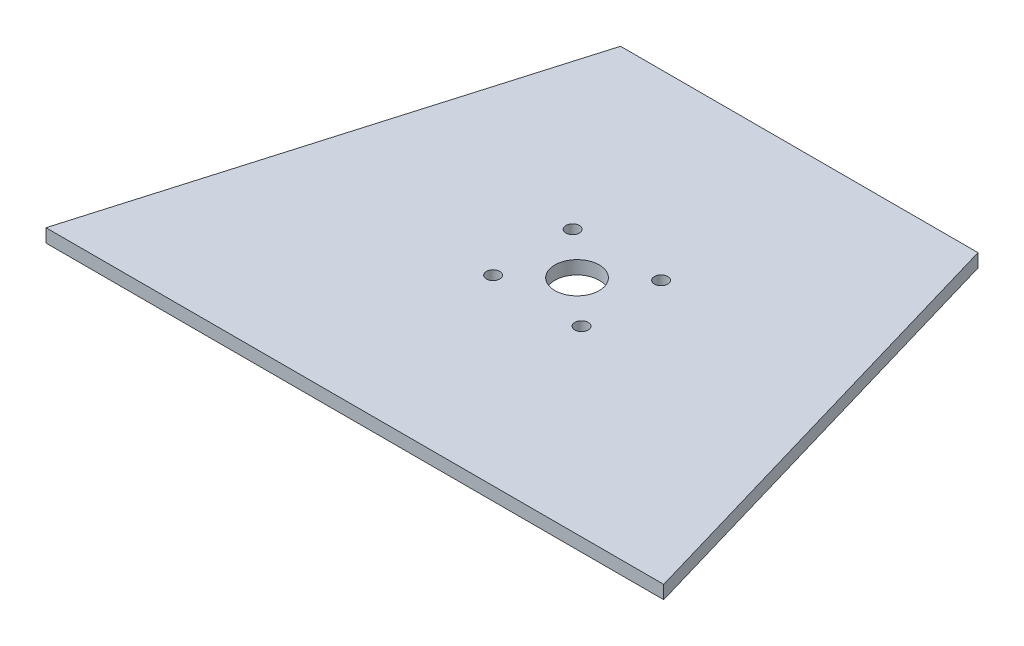
ISO-10303-21;
HEADER;
FILE_DESCRIPTION(('STEP AP214'),'2;1');
FILE_NAME('part.step','',(''),(''),'','','');
FILE_SCHEMA(('AUTOMOTIVE_DESIGN { 1 0 10303 214 1 1 1 1 }'));
ENDSEC;
DATA;
#1=APPLICATION_CONTEXT('core data for automotive mechanical design processes');
#2=APPLICATION_PROTOCOL_DEFINITION('international standard','automotive_design',2000,#1);
#3=PRODUCT_CONTEXT('',#1,'mechanical');
#4=PRODUCT('Part','Part','',(#3));
#5=PRODUCT_RELATED_PRODUCT_CATEGORY('part','',(#4));
#6=PRODUCT_DEFINITION_FORMATION('','',#4);
#7=PRODUCT_DEFINITION_CONTEXT('part definition',#1,'design');
#8=PRODUCT_DEFINITION('design','',#6,#7);
#9=PRODUCT_DEFINITION_SHAPE('','',#8);
#10=(LENGTH_UNIT() NAMED_UNIT(*) SI_UNIT(.MILLI.,.METRE.));
#11=(NAMED_UNIT(*) PLANE_ANGLE_UNIT() SI_UNIT($,.RADIAN.));
#12=(NAMED_UNIT(*) SI_UNIT($,.STERADIAN.) SOLID_ANGLE_UNIT());
#13=UNCERTAINTY_MEASURE_WITH_UNIT(LENGTH_MEASURE(1.E-05),#10,'distance_accuracy_value','');
#14=(GEOMETRIC_REPRESENTATION_CONTEXT(3) GLOBAL_UNCERTAINTY_ASSIGNED_CONTEXT((#13)) GLOBAL_UNIT_ASSIGNED_CONTEXT((#10,
#11,#12)) REPRESENTATION_CONTEXT('',''));
#15=CARTESIAN_POINT('',(0.,0.,0.));
#16=DIRECTION('',(0.,0.,1.));
#17=DIRECTION('',(1.,0.,0.));
#18=AXIS2_PLACEMENT_3D('',#15,#16,#17);
#19=CARTESIAN_POINT('',(0.,3.,0.));
#20=DIRECTION('',(0.959707262339068,0.,0.281001727065248));
#21=DIRECTION('',(0.281001727065248,0.,-0.959707262339068));
#22=AXIS2_PLACEMENT_3D('',#19,#20,#21);
#23=PLANE('',#22);
#24=DIRECTION('',(-0.281001727065248,0.,0.959707262339068));
#25=VECTOR('',#24,1.);
#26=CARTESIAN_POINT('',(0.,0.,0.));
#27=LINE('',#26,#25);
#28=CARTESIAN_POINT('',(29.2799417168492,0.,-100.));
#29=VERTEX_POINT('',#28);
#30=CARTESIAN_POINT('',(0.,0.,0.));
#31=VERTEX_POINT('',#30);
#32=EDGE_CURVE('E101',#29,#31,#27,.T.);
#33=ORIENTED_EDGE('',*,*,#32,.T.);
#34=DIRECTION('',(0.,-1.,0.));
#35=VECTOR('',#34,1.);
#36=CARTESIAN_POINT('',(0.,3.,0.));
#37=LINE('',#36,#35);
#38=CARTESIAN_POINT('',(0.,3.,0.));
#39=VERTEX_POINT('',#38);
#40=EDGE_CURVE('E11',#39,#31,#37,.T.);
#41=ORIENTED_EDGE('',*,*,#40,.F.);
#42=DIRECTION('',(-0.281001727065248,0.,0.959707262339068));
#43=VECTOR('',#42,1.);
#44=CARTESIAN_POINT('',(0.,3.,0.));
#45=LINE('',#44,#43);
#46=CARTESIAN_POINT('',(29.2799417168492,3.,-100.));
#47=VERTEX_POINT('',#46);
#48=EDGE_CURVE('E89',#47,#39,#45,.T.);
#49=ORIENTED_EDGE('',*,*,#48,.F.);
#50=DIRECTION('',(0.,-1.,0.));
#51=VECTOR('',#50,1.);
#52=CARTESIAN_POINT('',(29.2799417168492,3.,-100.));
#53=LINE('',#52,#51);
#54=EDGE_CURVE('E97',#47,#29,#53,.T.);
#55=ORIENTED_EDGE('',*,*,#54,.T.);
#56=EDGE_LOOP('',(#33,#41,#49,#55));
#57=FACE_BOUND('',#56,.T.);
#58=ADVANCED_FACE('F38',(#57),#23,.F.);
#59=CARTESIAN_POINT('',(0.,3.,0.));
#60=DIRECTION('',(0.,0.,-1.));
#61=DIRECTION('',(-1.,0.,0.));
#62=AXIS2_PLACEMENT_3D('',#59,#60,#61);
#63=PLANE('',#62);
#64=DIRECTION('',(1.,0.,0.));
#65=VECTOR('',#64,1.);
#66=CARTESIAN_POINT('',(0.,0.,0.));
#67=LINE('',#66,#65);
#68=CARTESIAN_POINT('',(139.,0.,0.));
#69=VERTEX_POINT('',#68);
#70=EDGE_CURVE('E93',#31,#69,#67,.T.);
#71=ORIENTED_EDGE('',*,*,#70,.T.);
#72=DIRECTION('',(0.,-1.,0.));
#73=VECTOR('',#72,1.);
#74=CARTESIAN_POINT('',(139.,3.,0.));
#75=LINE('',#74,#73);
#76=CARTESIAN_POINT('',(139.,3.,0.));
#77=VERTEX_POINT('',#76);
#78=EDGE_CURVE('E46',#77,#69,#75,.T.);
#79=ORIENTED_EDGE('',*,*,#78,.F.);
#80=DIRECTION('',(1.,0.,0.));
#81=VECTOR('',#80,1.);
#82=CARTESIAN_POINT('',(0.,3.,0.));
#83=LINE('',#82,#81);
#84=EDGE_CURVE('E84',#39,#77,#83,.T.);
#85=ORIENTED_EDGE('',*,*,#84,.F.);
#86=ORIENTED_EDGE('',*,*,#40,.T.);
#87=EDGE_LOOP('',(#71,#79,#85,#86));
#88=FACE_BOUND('',#87,.T.);
#89=ADVANCED_FACE('F92',(#88),#63,.F.);
#90=CARTESIAN_POINT('',(139.,3.,0.));
#91=DIRECTION('',(-0.959707262339066,0.,0.281001727065255));
#92=DIRECTION('',(0.281001727065255,0.,0.959707262339066));
#93=AXIS2_PLACEMENT_3D('',#90,#91,#92);
#94=PLANE('',#93);
#95=DIRECTION('',(-0.281001727065255,0.,-0.959707262339066));
#96=VECTOR('',#95,1.);
#97=CARTESIAN_POINT('',(139.,0.,0.));
#98=LINE('',#97,#96);
#99=CARTESIAN_POINT('',(109.72005828315,0.,-100.));
#100=VERTEX_POINT('',#99);
#101=EDGE_CURVE('E71',#69,#100,#98,.T.);
#102=ORIENTED_EDGE('',*,*,#101,.T.);
#103=DIRECTION('',(0.,-1.,0.));
#104=VECTOR('',#103,1.);
#105=CARTESIAN_POINT('',(109.72005828315,3.,-100.));
#106=LINE('',#105,#104);
#107=CARTESIAN_POINT('',(109.72005828315,3.,-100.));
#108=VERTEX_POINT('',#107);
#109=EDGE_CURVE('E94',#108,#100,#106,.T.);
#110=ORIENTED_EDGE('',*,*,#109,.F.);
#111=DIRECTION('',(-0.281001727065255,0.,-0.959707262339066));
#112=VECTOR('',#111,1.);
#113=CARTESIAN_POINT('',(139.,3.,0.));
#114=LINE('',#113,#112);
#115=EDGE_CURVE('E87',#77,#108,#114,.T.);
#116=ORIENTED_EDGE('',*,*,#115,.F.);
#117=ORIENTED_EDGE('',*,*,#78,.T.);
#118=EDGE_LOOP('',(#102,#110,#116,#117));
#119=FACE_BOUND('',#118,.T.);
#120=ADVANCED_FACE('F95',(#119),#94,.F.);
#121=CARTESIAN_POINT('',(29.2799417168492,3.,-100.));
#122=DIRECTION('',(0.,0.,1.));
#123=DIRECTION('',(1.,0.,0.));
#124=AXIS2_PLACEMENT_3D('',#121,#122,#123);
#125=PLANE('',#124);
#126=DIRECTION('',(-1.,0.,0.));
#127=VECTOR('',#126,1.);
#128=CARTESIAN_POINT('',(29.2799417168492,0.,-100.));
#129=LINE('',#128,#127);
#130=EDGE_CURVE('E77',#100,#29,#129,.T.);
#131=ORIENTED_EDGE('',*,*,#130,.T.);
#132=ORIENTED_EDGE('',*,*,#54,.F.);
#133=DIRECTION('',(-1.,0.,0.));
#134=VECTOR('',#133,1.);
#135=CARTESIAN_POINT('',(29.2799417168492,3.,-100.));
#136=LINE('',#135,#134);
#137=EDGE_CURVE('E54',#108,#47,#136,.T.);
#138=ORIENTED_EDGE('',*,*,#137,.F.);
#139=ORIENTED_EDGE('',*,*,#109,.T.);
#140=EDGE_LOOP('',(#131,#132,#138,#139));
#141=FACE_BOUND('',#140,.T.);
#142=ADVANCED_FACE('F109',(#141),#125,.F.);
#143=CARTESIAN_POINT('',(0.,3.,0.));
#144=DIRECTION('',(0.,-1.,0.));
#145=DIRECTION('',(0.,0.,-1.));
#146=AXIS2_PLACEMENT_3D('',#143,#144,#145);
#147=PLANE('',#146);
#148=CARTESIAN_POINT('',(59.5499999999998,3.,-41.0500000000001));
#149=DIRECTION('',(0.,-1.,0.));
#150=DIRECTION('',(0.,0.,-1.));
#151=AXIS2_PLACEMENT_3D('',#148,#149,#150);
#152=CIRCLE('',#151,1.5);
#153=CARTESIAN_POINT('',(59.5499999999998,3.,-42.5500000000001));
#154=VERTEX_POINT('',#153);
#155=EDGE_CURVE('E138',#154,#154,#152,.T.);
#156=ORIENTED_EDGE('',*,*,#155,.T.);
#157=EDGE_LOOP('',(#156));
#158=FACE_BOUND('',#157,.T.);
#159=CARTESIAN_POINT('',(79.4499999999998,3.,-41.05));
#160=DIRECTION('',(0.,-1.,0.));
#161=DIRECTION('',(0.,0.,-1.));
#162=AXIS2_PLACEMENT_3D('',#159,#160,#161);
#163=CIRCLE('',#162,1.5);
#164=CARTESIAN_POINT('',(79.4499999999998,3.,-42.55));
#165=VERTEX_POINT('',#164);
#166=EDGE_CURVE('E132',#165,#165,#163,.T.);
#167=ORIENTED_EDGE('',*,*,#166,.T.);
#168=EDGE_LOOP('',(#167));
#169=FACE_BOUND('',#168,.T.);
#170=CARTESIAN_POINT('',(79.4499999999999,3.,-58.95));
#171=DIRECTION('',(0.,-1.,0.));
#172=DIRECTION('',(0.,0.,-1.));
#173=AXIS2_PLACEMENT_3D('',#170,#171,#172);
#174=CIRCLE('',#173,1.5);
#175=CARTESIAN_POINT('',(79.4499999999999,3.,-60.45));
#176=VERTEX_POINT('',#175);
#177=EDGE_CURVE('E126',#176,#176,#174,.T.);
#178=ORIENTED_EDGE('',*,*,#177,.T.);
#179=EDGE_LOOP('',(#178));
#180=FACE_BOUND('',#179,.T.);
#181=CARTESIAN_POINT('',(59.5499999999999,3.,-58.9500000000001));
#182=DIRECTION('',(0.,-1.,0.));
#183=DIRECTION('',(0.,0.,-1.));
#184=AXIS2_PLACEMENT_3D('',#181,#182,#183);
#185=CIRCLE('',#184,1.5);
#186=CARTESIAN_POINT('',(59.5499999999999,3.,-60.4500000000001));
#187=VERTEX_POINT('',#186);
#188=EDGE_CURVE('E120',#187,#187,#185,.T.);
#189=ORIENTED_EDGE('',*,*,#188,.T.);
#190=EDGE_LOOP('',(#189));
#191=FACE_BOUND('',#190,.T.);
#192=CARTESIAN_POINT('',(69.4999999999998,3.,-50.));
#193=DIRECTION('',(0.,-1.,0.));
#194=DIRECTION('',(0.,0.,-1.));
#195=AXIS2_PLACEMENT_3D('',#192,#193,#194);
#196=CIRCLE('',#195,5.);
#197=CARTESIAN_POINT('',(69.4999999999998,3.,-55.));
#198=VERTEX_POINT('',#197);
#199=EDGE_CURVE('E104',#198,#198,#196,.T.);
#200=ORIENTED_EDGE('',*,*,#199,.T.);
#201=EDGE_LOOP('',(#200));
#202=FACE_BOUND('',#201,.T.);
#203=ORIENTED_EDGE('',*,*,#48,.T.);
#204=ORIENTED_EDGE('',*,*,#84,.T.);
#205=ORIENTED_EDGE('',*,*,#115,.T.);
#206=ORIENTED_EDGE('',*,*,#137,.T.);
#207=EDGE_LOOP('',(#203,#204,#205,#206));
#208=FACE_BOUND('',#207,.T.);
#209=ADVANCED_FACE('F85',(#158,#169,#180,#191,#202,#208),#147,.F.);
#210=CARTESIAN_POINT('',(0.,0.,0.));
#211=DIRECTION('',(0.,-1.,0.));
#212=DIRECTION('',(0.,0.,-1.));
#213=AXIS2_PLACEMENT_3D('',#210,#211,#212);
#214=PLANE('',#213);
#215=CARTESIAN_POINT('',(59.5499999999998,0.,-41.0500000000001));
#216=DIRECTION('',(0.,-1.,0.));
#217=DIRECTION('',(0.,0.,-1.));
#218=AXIS2_PLACEMENT_3D('',#215,#216,#217);
#219=CIRCLE('',#218,1.5);
#220=CARTESIAN_POINT('',(59.5499999999998,0.,-42.5500000000001));
#221=VERTEX_POINT('',#220);
#222=EDGE_CURVE('E141',#221,#221,#219,.T.);
#223=ORIENTED_EDGE('',*,*,#222,.F.);
#224=EDGE_LOOP('',(#223));
#225=FACE_BOUND('',#224,.T.);
#226=CARTESIAN_POINT('',(79.4499999999998,0.,-41.05));
#227=DIRECTION('',(0.,-1.,0.));
#228=DIRECTION('',(0.,0.,-1.));
#229=AXIS2_PLACEMENT_3D('',#226,#227,#228);
#230=CIRCLE('',#229,1.5);
#231=CARTESIAN_POINT('',(79.4499999999998,0.,-42.55));
#232=VERTEX_POINT('',#231);
#233=EDGE_CURVE('E135',#232,#232,#230,.T.);
#234=ORIENTED_EDGE('',*,*,#233,.F.);
#235=EDGE_LOOP('',(#234));
#236=FACE_BOUND('',#235,.T.);
#237=CARTESIAN_POINT('',(79.4499999999999,0.,-58.95));
#238=DIRECTION('',(0.,-1.,0.));
#239=DIRECTION('',(0.,0.,-1.));
#240=AXIS2_PLACEMENT_3D('',#237,#238,#239);
#241=CIRCLE('',#240,1.5);
#242=CARTESIAN_POINT('',(79.4499999999999,0.,-60.45));
#243=VERTEX_POINT('',#242);
#244=EDGE_CURVE('E129',#243,#243,#241,.T.);
#245=ORIENTED_EDGE('',*,*,#244,.F.);
#246=EDGE_LOOP('',(#245));
#247=FACE_BOUND('',#246,.T.);
#248=CARTESIAN_POINT('',(59.5499999999999,0.,-58.9500000000001));
#249=DIRECTION('',(0.,-1.,0.));
#250=DIRECTION('',(0.,0.,-1.));
#251=AXIS2_PLACEMENT_3D('',#248,#249,#250);
#252=CIRCLE('',#251,1.5);
#253=CARTESIAN_POINT('',(59.5499999999999,0.,-60.4500000000001));
#254=VERTEX_POINT('',#253);
#255=EDGE_CURVE('E123',#254,#254,#252,.T.);
#256=ORIENTED_EDGE('',*,*,#255,.F.);
#257=EDGE_LOOP('',(#256));
#258=FACE_BOUND('',#257,.T.);
#259=CARTESIAN_POINT('',(69.4999999999998,0.,-50.));
#260=DIRECTION('',(0.,-1.,0.));
#261=DIRECTION('',(0.,0.,-1.));
#262=AXIS2_PLACEMENT_3D('',#259,#260,#261);
#263=CIRCLE('',#262,5.);
#264=CARTESIAN_POINT('',(69.4999999999998,0.,-55.));
#265=VERTEX_POINT('',#264);
#266=EDGE_CURVE('E117',#265,#265,#263,.T.);
#267=ORIENTED_EDGE('',*,*,#266,.F.);
#268=EDGE_LOOP('',(#267));
#269=FACE_BOUND('',#268,.T.);
#270=ORIENTED_EDGE('',*,*,#32,.F.);
#271=ORIENTED_EDGE('',*,*,#130,.F.);
#272=ORIENTED_EDGE('',*,*,#101,.F.);
#273=ORIENTED_EDGE('',*,*,#70,.F.);
#274=EDGE_LOOP('',(#270,#271,#272,#273));
#275=FACE_BOUND('',#274,.T.);
#276=ADVANCED_FACE('F112',(#225,#236,#247,#258,#269,#275),#214,.T.);
#277=CARTESIAN_POINT('',(69.4999999999998,0.,-50.));
#278=DIRECTION('',(0.,-1.,0.));
#279=DIRECTION('',(0.,0.,-1.));
#280=AXIS2_PLACEMENT_3D('',#277,#278,#279);
#281=CYLINDRICAL_SURFACE('',#280,5.);
#282=ORIENTED_EDGE('',*,*,#199,.F.);
#283=EDGE_LOOP('',(#282));
#284=FACE_BOUND('',#283,.T.);
#285=ORIENTED_EDGE('',*,*,#266,.T.);
#286=EDGE_LOOP('',(#285));
#287=FACE_BOUND('',#286,.T.);
#288=ADVANCED_FACE('F149',(#284,#287),#281,.F.);
#289=CARTESIAN_POINT('',(59.5499999999999,0.,-58.9500000000001));
#290=DIRECTION('',(0.,-1.,0.));
#291=DIRECTION('',(0.,0.,-1.));
#292=AXIS2_PLACEMENT_3D('',#289,#290,#291);
#293=CYLINDRICAL_SURFACE('',#292,1.5);
#294=ORIENTED_EDGE('',*,*,#188,.F.);
#295=EDGE_LOOP('',(#294));
#296=FACE_BOUND('',#295,.T.);
#297=ORIENTED_EDGE('',*,*,#255,.T.);
#298=EDGE_LOOP('',(#297));
#299=FACE_BOUND('',#298,.T.);
#300=ADVANCED_FACE('F160',(#296,#299),#293,.F.);
#301=CARTESIAN_POINT('',(79.4499999999999,0.,-58.95));
#302=DIRECTION('',(0.,-1.,0.));
#303=DIRECTION('',(0.,0.,-1.));
#304=AXIS2_PLACEMENT_3D('',#301,#302,#303);
#305=CYLINDRICAL_SURFACE('',#304,1.5);
#306=ORIENTED_EDGE('',*,*,#177,.F.);
#307=EDGE_LOOP('',(#306));
#308=FACE_BOUND('',#307,.T.);
#309=ORIENTED_EDGE('',*,*,#244,.T.);
#310=EDGE_LOOP('',(#309));
#311=FACE_BOUND('',#310,.T.);
#312=ADVANCED_FACE('F166',(#308,#311),#305,.F.);
#313=CARTESIAN_POINT('',(79.4499999999998,0.,-41.05));
#314=DIRECTION('',(0.,-1.,0.));
#315=DIRECTION('',(0.,0.,-1.));
#316=AXIS2_PLACEMENT_3D('',#313,#314,#315);
#317=CYLINDRICAL_SURFACE('',#316,1.5);
#318=ORIENTED_EDGE('',*,*,#166,.F.);
#319=EDGE_LOOP('',(#318));
#320=FACE_BOUND('',#319,.T.);
#321=ORIENTED_EDGE('',*,*,#233,.T.);
#322=EDGE_LOOP('',(#321));
#323=FACE_BOUND('',#322,.T.);
#324=ADVANCED_FACE('F197',(#320,#323),#317,.F.);
#325=CARTESIAN_POINT('',(59.5499999999998,0.,-41.0500000000001));
#326=DIRECTION('',(0.,-1.,0.));
#327=DIRECTION('',(0.,0.,-1.));
#328=AXIS2_PLACEMENT_3D('',#325,#326,#327);
#329=CYLINDRICAL_SURFACE('',#328,1.5);
#330=ORIENTED_EDGE('',*,*,#155,.F.);
#331=EDGE_LOOP('',(#330));
#332=FACE_BOUND('',#331,.T.);
#333=ORIENTED_EDGE('',*,*,#222,.T.);
#334=EDGE_LOOP('',(#333));
#335=FACE_BOUND('',#334,.T.);
#336=ADVANCED_FACE('F145',(#332,#335),#329,.F.);
#337=CLOSED_SHELL('',(#58,#89,#120,#142,#209,#276,#288,#300,#312,#324,#336));
#338=MANIFOLD_SOLID_BREP('B2',#337);
#339=ADVANCED_BREP_SHAPE_REPRESENTATION('',(#18,#338),#14);
#340=SHAPE_DEFINITION_REPRESENTATION(#9,#339);
ENDSEC;
END-ISO-10303-21;
